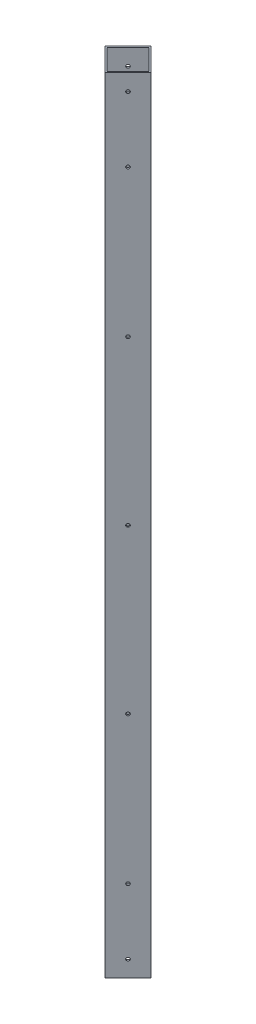
ISO-10303-21;
HEADER;
FILE_DESCRIPTION(('STEP AP214'),'2;1');
FILE_NAME('part.step','',(''),(''),'','','');
FILE_SCHEMA(('AUTOMOTIVE_DESIGN { 1 0 10303 214 1 1 1 1 }'));
ENDSEC;
DATA;
#1=APPLICATION_CONTEXT('core data for automotive mechanical design processes');
#2=APPLICATION_PROTOCOL_DEFINITION('international standard','automotive_design',2000,#1);
#3=PRODUCT_CONTEXT('',#1,'mechanical');
#4=PRODUCT('Part','Part','',(#3));
#5=PRODUCT_RELATED_PRODUCT_CATEGORY('part','',(#4));
#6=PRODUCT_DEFINITION_FORMATION('','',#4);
#7=PRODUCT_DEFINITION_CONTEXT('part definition',#1,'design');
#8=PRODUCT_DEFINITION('design','',#6,#7);
#9=PRODUCT_DEFINITION_SHAPE('','',#8);
#10=(LENGTH_UNIT() NAMED_UNIT(*) SI_UNIT(.MILLI.,.METRE.));
#11=(NAMED_UNIT(*) PLANE_ANGLE_UNIT() SI_UNIT($,.RADIAN.));
#12=(NAMED_UNIT(*) SI_UNIT($,.STERADIAN.) SOLID_ANGLE_UNIT());
#13=UNCERTAINTY_MEASURE_WITH_UNIT(LENGTH_MEASURE(1.E-05),#10,'distance_accuracy_value','');
#14=(GEOMETRIC_REPRESENTATION_CONTEXT(3) GLOBAL_UNCERTAINTY_ASSIGNED_CONTEXT((#13)) GLOBAL_UNIT_ASSIGNED_CONTEXT((#10,
#11,#12)) REPRESENTATION_CONTEXT('',''));
#15=CARTESIAN_POINT('',(0.,0.,0.));
#16=DIRECTION('',(0.,0.,1.));
#17=DIRECTION('',(1.,0.,0.));
#18=AXIS2_PLACEMENT_3D('',#15,#16,#17);
#19=CARTESIAN_POINT('',(0.,240.,0.));
#20=DIRECTION('',(0.,1.,0.));
#21=DIRECTION('',(0.,0.,1.));
#22=AXIS2_PLACEMENT_3D('',#19,#20,#21);
#23=PLANE('',#22);
#24=DIRECTION('',(0.707106781186544,0.,-0.707106781186551));
#25=VECTOR('',#24,1.);
#26=CARTESIAN_POINT('',(1.472650518087E-13,240.,14.1421356237309));
#27=LINE('',#26,#25);
#28=CARTESIAN_POINT('',(1.472650518087E-13,240.,14.1421356237309));
#29=VERTEX_POINT('',#28);
#30=CARTESIAN_POINT('',(14.1421356237309,240.,0.));
#31=VERTEX_POINT('',#30);
#32=EDGE_CURVE('E139',#29,#31,#27,.T.);
#33=ORIENTED_EDGE('',*,*,#32,.T.);
#34=DIRECTION('',(-0.707106781186549,0.,-0.707106781186546));
#35=VECTOR('',#34,1.);
#36=CARTESIAN_POINT('',(14.1421356237309,240.,0.));
#37=LINE('',#36,#35);
#38=CARTESIAN_POINT('',(0.,240.,-14.1421356237309));
#39=VERTEX_POINT('',#38);
#40=EDGE_CURVE('E142',#31,#39,#37,.T.);
#41=ORIENTED_EDGE('',*,*,#40,.T.);
#42=DIRECTION('',(-0.707106781186544,0.,0.707106781186551));
#43=VECTOR('',#42,1.);
#44=CARTESIAN_POINT('',(0.,240.,-14.1421356237309));
#45=LINE('',#44,#43);
#46=CARTESIAN_POINT('',(-14.1421356237309,240.,0.));
#47=VERTEX_POINT('',#46);
#48=EDGE_CURVE('E145',#39,#47,#45,.T.);
#49=ORIENTED_EDGE('',*,*,#48,.T.);
#50=DIRECTION('',(0.707106781186554,0.,0.707106781186541));
#51=VECTOR('',#50,1.);
#52=CARTESIAN_POINT('',(-14.1421356237309,240.,0.));
#53=LINE('',#52,#51);
#54=EDGE_CURVE('E147',#47,#29,#53,.T.);
#55=ORIENTED_EDGE('',*,*,#54,.T.);
#56=EDGE_LOOP('',(#33,#41,#49,#55));
#57=FACE_BOUND('',#56,.T.);
#58=DIRECTION('',(-0.707106781186545,0.,-0.707106781186549));
#59=VECTOR('',#58,1.);
#60=CARTESIAN_POINT('',(12.7279220613579,240.,0.));
#61=LINE('',#60,#59);
#62=CARTESIAN_POINT('',(12.7279220613579,240.,0.));
#63=VERTEX_POINT('',#62);
#64=CARTESIAN_POINT('',(0.,240.,-12.7279220613579));
#65=VERTEX_POINT('',#64);
#66=EDGE_CURVE('E109',#63,#65,#61,.T.);
#67=ORIENTED_EDGE('',*,*,#66,.F.);
#68=DIRECTION('',(0.707106781186552,0.,-0.707106781186543));
#69=VECTOR('',#68,1.);
#70=CARTESIAN_POINT('',(0.,240.,12.7279220613578));
#71=LINE('',#70,#69);
#72=CARTESIAN_POINT('',(0.,240.,12.7279220613578));
#73=VERTEX_POINT('',#72);
#74=EDGE_CURVE('E101',#73,#63,#71,.T.);
#75=ORIENTED_EDGE('',*,*,#74,.F.);
#76=DIRECTION('',(0.707106781186545,0.,0.70710678118655));
#77=VECTOR('',#76,1.);
#78=CARTESIAN_POINT('',(-12.7279220613578,240.,0.));
#79=LINE('',#78,#77);
#80=CARTESIAN_POINT('',(-12.7279220613578,240.,0.));
#81=VERTEX_POINT('',#80);
#82=EDGE_CURVE('E123',#81,#73,#79,.T.);
#83=ORIENTED_EDGE('',*,*,#82,.F.);
#84=DIRECTION('',(-0.707106781186547,0.,0.707106781186548));
#85=VECTOR('',#84,1.);
#86=CARTESIAN_POINT('',(0.,240.,-12.7279220613579));
#87=LINE('',#86,#85);
#88=EDGE_CURVE('E121',#65,#81,#87,.T.);
#89=ORIENTED_EDGE('',*,*,#88,.F.);
#90=EDGE_LOOP('',(#67,#75,#83,#89));
#91=FACE_BOUND('',#90,.T.);
#92=ADVANCED_FACE('F34',(#57,#91),#23,.T.);
#93=CARTESIAN_POINT('',(0.,-240.,0.));
#94=DIRECTION('',(0.,1.,0.));
#95=DIRECTION('',(0.,0.,1.));
#96=AXIS2_PLACEMENT_3D('',#93,#94,#95);
#97=PLANE('',#96);
#98=DIRECTION('',(0.707106781186544,0.,-0.707106781186551));
#99=VECTOR('',#98,1.);
#100=CARTESIAN_POINT('',(1.472650518087E-13,-240.,14.1421356237309));
#101=LINE('',#100,#99);
#102=CARTESIAN_POINT('',(1.472650518087E-13,-240.,14.1421356237309));
#103=VERTEX_POINT('',#102);
#104=CARTESIAN_POINT('',(14.1421356237309,-240.,0.));
#105=VERTEX_POINT('',#104);
#106=EDGE_CURVE('E117',#103,#105,#101,.T.);
#107=ORIENTED_EDGE('',*,*,#106,.F.);
#108=DIRECTION('',(0.707106781186554,0.,0.707106781186541));
#109=VECTOR('',#108,1.);
#110=CARTESIAN_POINT('',(-14.1421356237309,-240.,0.));
#111=LINE('',#110,#109);
#112=CARTESIAN_POINT('',(-14.1421356237309,-240.,0.));
#113=VERTEX_POINT('',#112);
#114=EDGE_CURVE('E143',#113,#103,#111,.T.);
#115=ORIENTED_EDGE('',*,*,#114,.F.);
#116=DIRECTION('',(-0.707106781186544,0.,0.707106781186551));
#117=VECTOR('',#116,1.);
#118=CARTESIAN_POINT('',(0.,-240.,-14.1421356237309));
#119=LINE('',#118,#117);
#120=CARTESIAN_POINT('',(0.,-240.,-14.1421356237309));
#121=VERTEX_POINT('',#120);
#122=EDGE_CURVE('E154',#121,#113,#119,.T.);
#123=ORIENTED_EDGE('',*,*,#122,.F.);
#124=DIRECTION('',(-0.707106781186549,0.,-0.707106781186546));
#125=VECTOR('',#124,1.);
#126=CARTESIAN_POINT('',(14.1421356237309,-240.,0.));
#127=LINE('',#126,#125);
#128=EDGE_CURVE('E152',#105,#121,#127,.T.);
#129=ORIENTED_EDGE('',*,*,#128,.F.);
#130=EDGE_LOOP('',(#107,#115,#123,#129));
#131=FACE_BOUND('',#130,.T.);
#132=DIRECTION('',(0.707106781186552,0.,-0.707106781186543));
#133=VECTOR('',#132,1.);
#134=CARTESIAN_POINT('',(0.,-240.,12.7279220613578));
#135=LINE('',#134,#133);
#136=CARTESIAN_POINT('',(0.,-240.,12.7279220613578));
#137=VERTEX_POINT('',#136);
#138=CARTESIAN_POINT('',(12.7279220613579,-240.,0.));
#139=VERTEX_POINT('',#138);
#140=EDGE_CURVE('E59',#137,#139,#135,.T.);
#141=ORIENTED_EDGE('',*,*,#140,.T.);
#142=DIRECTION('',(-0.707106781186545,0.,-0.707106781186549));
#143=VECTOR('',#142,1.);
#144=CARTESIAN_POINT('',(12.7279220613579,-240.,0.));
#145=LINE('',#144,#143);
#146=CARTESIAN_POINT('',(0.,-240.,-12.7279220613579));
#147=VERTEX_POINT('',#146);
#148=EDGE_CURVE('E116',#139,#147,#145,.T.);
#149=ORIENTED_EDGE('',*,*,#148,.T.);
#150=DIRECTION('',(-0.707106781186547,0.,0.707106781186548));
#151=VECTOR('',#150,1.);
#152=CARTESIAN_POINT('',(0.,-240.,-12.7279220613579));
#153=LINE('',#152,#151);
#154=CARTESIAN_POINT('',(-12.7279220613578,-240.,0.));
#155=VERTEX_POINT('',#154);
#156=EDGE_CURVE('E131',#147,#155,#153,.T.);
#157=ORIENTED_EDGE('',*,*,#156,.T.);
#158=DIRECTION('',(0.707106781186545,0.,0.70710678118655));
#159=VECTOR('',#158,1.);
#160=CARTESIAN_POINT('',(-12.7279220613578,-240.,0.));
#161=LINE('',#160,#159);
#162=EDGE_CURVE('E110',#155,#137,#161,.T.);
#163=ORIENTED_EDGE('',*,*,#162,.T.);
#164=EDGE_LOOP('',(#141,#149,#157,#163));
#165=FACE_BOUND('',#164,.T.);
#166=ADVANCED_FACE('F267',(#131,#165),#97,.F.);
#167=CARTESIAN_POINT('',(1.472650518087E-13,240.,14.1421356237309));
#168=DIRECTION('',(-0.707106781186551,0.,-0.707106781186544));
#169=DIRECTION('',(-0.707106781186544,0.,0.707106781186551));
#170=AXIS2_PLACEMENT_3D('',#167,#168,#169);
#171=PLANE('',#170);
#172=CARTESIAN_POINT('',(7.07106781186554,100.,7.07106781186546));
#173=DIRECTION('',(0.707106781186551,0.,0.707106781186544));
#174=DIRECTION('',(0.707106781186544,0.,-0.707106781186551));
#175=AXIS2_PLACEMENT_3D('',#172,#173,#174);
#176=CIRCLE('',#175,1.);
#177=CARTESIAN_POINT('',(7.77817459305208,100.,6.36396103067891));
#178=VERTEX_POINT('',#177);
#179=EDGE_CURVE('E187',#178,#178,#176,.T.);
#180=ORIENTED_EDGE('',*,*,#179,.F.);
#181=EDGE_LOOP('',(#180));
#182=FACE_BOUND('',#181,.T.);
#183=CARTESIAN_POINT('',(7.07106781186554,0.,7.07106781186546));
#184=DIRECTION('',(0.707106781186551,0.,0.707106781186544));
#185=DIRECTION('',(0.707106781186544,0.,-0.707106781186551));
#186=AXIS2_PLACEMENT_3D('',#183,#184,#185);
#187=CIRCLE('',#186,1.);
#188=CARTESIAN_POINT('',(7.77817459305208,0.,6.36396103067891));
#189=VERTEX_POINT('',#188);
#190=EDGE_CURVE('E484',#189,#189,#187,.T.);
#191=ORIENTED_EDGE('',*,*,#190,.F.);
#192=EDGE_LOOP('',(#191));
#193=FACE_BOUND('',#192,.T.);
#194=CARTESIAN_POINT('',(7.07106781186554,-100.,7.07106781186546));
#195=DIRECTION('',(0.707106781186551,0.,0.707106781186544));
#196=DIRECTION('',(0.707106781186544,0.,-0.707106781186551));
#197=AXIS2_PLACEMENT_3D('',#194,#195,#196);
#198=CIRCLE('',#197,1.);
#199=CARTESIAN_POINT('',(7.77817459305208,-100.,6.36396103067891));
#200=VERTEX_POINT('',#199);
#201=EDGE_CURVE('E487',#200,#200,#198,.T.);
#202=ORIENTED_EDGE('',*,*,#201,.F.);
#203=EDGE_LOOP('',(#202));
#204=FACE_BOUND('',#203,.T.);
#205=CARTESIAN_POINT('',(7.07106781186554,230.,7.07106781186546));
#206=DIRECTION('',(0.707106781186551,0.,0.707106781186544));
#207=DIRECTION('',(0.707106781186544,0.,-0.707106781186551));
#208=AXIS2_PLACEMENT_3D('',#205,#206,#207);
#209=CIRCLE('',#208,1.);
#210=CARTESIAN_POINT('',(7.77817459305208,230.,6.36396103067891));
#211=VERTEX_POINT('',#210);
#212=EDGE_CURVE('E168',#211,#211,#209,.T.);
#213=ORIENTED_EDGE('',*,*,#212,.F.);
#214=EDGE_LOOP('',(#213));
#215=FACE_BOUND('',#214,.T.);
#216=CARTESIAN_POINT('',(7.07106781186554,190.,7.07106781186546));
#217=DIRECTION('',(0.707106781186551,0.,0.707106781186544));
#218=DIRECTION('',(0.707106781186544,0.,-0.707106781186551));
#219=AXIS2_PLACEMENT_3D('',#216,#217,#218);
#220=CIRCLE('',#219,1.);
#221=CARTESIAN_POINT('',(7.77817459305208,190.,6.36396103067891));
#222=VERTEX_POINT('',#221);
#223=EDGE_CURVE('E216',#222,#222,#220,.T.);
#224=ORIENTED_EDGE('',*,*,#223,.F.);
#225=EDGE_LOOP('',(#224));
#226=FACE_BOUND('',#225,.T.);
#227=CARTESIAN_POINT('',(7.07106781186554,-190.,7.07106781186546));
#228=DIRECTION('',(0.707106781186551,0.,0.707106781186544));
#229=DIRECTION('',(-0.707106781186544,0.,0.707106781186551));
#230=AXIS2_PLACEMENT_3D('',#227,#228,#229);
#231=CIRCLE('',#230,1.);
#232=CARTESIAN_POINT('',(6.36396103067899,-190.,7.77817459305202));
#233=VERTEX_POINT('',#232);
#234=EDGE_CURVE('E219',#233,#233,#231,.T.);
#235=ORIENTED_EDGE('',*,*,#234,.F.);
#236=EDGE_LOOP('',(#235));
#237=FACE_BOUND('',#236,.T.);
#238=CARTESIAN_POINT('',(7.07106781186554,-230.,7.07106781186546));
#239=DIRECTION('',(0.707106781186551,0.,0.707106781186544));
#240=DIRECTION('',(-0.707106781186544,0.,0.707106781186551));
#241=AXIS2_PLACEMENT_3D('',#238,#239,#240);
#242=CIRCLE('',#241,1.);
#243=CARTESIAN_POINT('',(6.36396103067899,-230.,7.77817459305202));
#244=VERTEX_POINT('',#243);
#245=EDGE_CURVE('E213',#244,#244,#242,.T.);
#246=ORIENTED_EDGE('',*,*,#245,.F.);
#247=EDGE_LOOP('',(#246));
#248=FACE_BOUND('',#247,.T.);
#249=ORIENTED_EDGE('',*,*,#106,.T.);
#250=DIRECTION('',(0.,-1.,0.));
#251=VECTOR('',#250,1.);
#252=CARTESIAN_POINT('',(14.1421356237309,240.,0.));
#253=LINE('',#252,#251);
#254=EDGE_CURVE('E11',#31,#105,#253,.T.);
#255=ORIENTED_EDGE('',*,*,#254,.F.);
#256=ORIENTED_EDGE('',*,*,#32,.F.);
#257=DIRECTION('',(0.,-1.,0.));
#258=VECTOR('',#257,1.);
#259=CARTESIAN_POINT('',(1.472650518087E-13,240.,14.1421356237309));
#260=LINE('',#259,#258);
#261=EDGE_CURVE('E149',#29,#103,#260,.T.);
#262=ORIENTED_EDGE('',*,*,#261,.T.);
#263=EDGE_LOOP('',(#249,#255,#256,#262));
#264=FACE_BOUND('',#263,.T.);
#265=ADVANCED_FACE('F36',(#182,#193,#204,#215,#226,#237,#248,#264),#171,.F.);
#266=CARTESIAN_POINT('',(14.1421356237309,240.,0.));
#267=DIRECTION('',(-0.707106781186546,0.,0.707106781186549));
#268=DIRECTION('',(0.707106781186549,0.,0.707106781186546));
#269=AXIS2_PLACEMENT_3D('',#266,#267,#268);
#270=PLANE('',#269);
#271=ORIENTED_EDGE('',*,*,#128,.T.);
#272=DIRECTION('',(0.,-1.,0.));
#273=VECTOR('',#272,1.);
#274=CARTESIAN_POINT('',(0.,240.,-14.1421356237309));
#275=LINE('',#274,#273);
#276=EDGE_CURVE('E43',#39,#121,#275,.T.);
#277=ORIENTED_EDGE('',*,*,#276,.F.);
#278=ORIENTED_EDGE('',*,*,#40,.F.);
#279=ORIENTED_EDGE('',*,*,#254,.T.);
#280=EDGE_LOOP('',(#271,#277,#278,#279));
#281=FACE_BOUND('',#280,.T.);
#282=ADVANCED_FACE('F283',(#281),#270,.F.);
#283=CARTESIAN_POINT('',(0.,240.,-14.1421356237309));
#284=DIRECTION('',(0.707106781186551,0.,0.707106781186544));
#285=DIRECTION('',(0.707106781186544,0.,-0.707106781186551));
#286=AXIS2_PLACEMENT_3D('',#283,#284,#285);
#287=PLANE('',#286);
#288=CARTESIAN_POINT('',(-7.07106781186549,100.,-7.07106781186541));
#289=DIRECTION('',(0.707106781186551,0.,0.707106781186544));
#290=DIRECTION('',(0.707106781186544,0.,-0.707106781186551));
#291=AXIS2_PLACEMENT_3D('',#288,#289,#290);
#292=CIRCLE('',#291,1.);
#293=CARTESIAN_POINT('',(-6.36396103067895,100.,-7.77817459305196));
#294=VERTEX_POINT('',#293);
#295=EDGE_CURVE('E210',#294,#294,#292,.T.);
#296=ORIENTED_EDGE('',*,*,#295,.T.);
#297=EDGE_LOOP('',(#296));
#298=FACE_BOUND('',#297,.T.);
#299=CARTESIAN_POINT('',(-7.07106781186549,0.,-7.07106781186541));
#300=DIRECTION('',(0.707106781186551,0.,0.707106781186544));
#301=DIRECTION('',(0.707106781186544,0.,-0.707106781186551));
#302=AXIS2_PLACEMENT_3D('',#299,#300,#301);
#303=CIRCLE('',#302,1.);
#304=CARTESIAN_POINT('',(-6.36396103067895,0.,-7.77817459305196));
#305=VERTEX_POINT('',#304);
#306=EDGE_CURVE('E195',#305,#305,#303,.T.);
#307=ORIENTED_EDGE('',*,*,#306,.T.);
#308=EDGE_LOOP('',(#307));
#309=FACE_BOUND('',#308,.T.);
#310=CARTESIAN_POINT('',(-7.07106781186549,-100.,-7.07106781186541));
#311=DIRECTION('',(0.707106781186551,0.,0.707106781186544));
#312=DIRECTION('',(0.707106781186544,0.,-0.707106781186551));
#313=AXIS2_PLACEMENT_3D('',#310,#311,#312);
#314=CIRCLE('',#313,1.);
#315=CARTESIAN_POINT('',(-6.36396103067895,-100.,-7.77817459305196));
#316=VERTEX_POINT('',#315);
#317=EDGE_CURVE('E191',#316,#316,#314,.T.);
#318=ORIENTED_EDGE('',*,*,#317,.T.);
#319=EDGE_LOOP('',(#318));
#320=FACE_BOUND('',#319,.T.);
#321=CARTESIAN_POINT('',(-7.07106781186549,230.,-7.07106781186541));
#322=DIRECTION('',(0.707106781186551,0.,0.707106781186544));
#323=DIRECTION('',(0.707106781186544,0.,-0.707106781186551));
#324=AXIS2_PLACEMENT_3D('',#321,#322,#323);
#325=CIRCLE('',#324,1.);
#326=CARTESIAN_POINT('',(-6.36396103067895,230.,-7.77817459305197));
#327=VERTEX_POINT('',#326);
#328=EDGE_CURVE('E129',#327,#327,#325,.T.);
#329=ORIENTED_EDGE('',*,*,#328,.T.);
#330=EDGE_LOOP('',(#329));
#331=FACE_BOUND('',#330,.T.);
#332=CARTESIAN_POINT('',(-7.07106781186549,190.,-7.07106781186541));
#333=DIRECTION('',(0.707106781186551,0.,0.707106781186544));
#334=DIRECTION('',(0.707106781186544,0.,-0.707106781186551));
#335=AXIS2_PLACEMENT_3D('',#332,#333,#334);
#336=CIRCLE('',#335,1.);
#337=CARTESIAN_POINT('',(-6.36396103067895,190.,-7.77817459305197));
#338=VERTEX_POINT('',#337);
#339=EDGE_CURVE('E183',#338,#338,#336,.T.);
#340=ORIENTED_EDGE('',*,*,#339,.T.);
#341=EDGE_LOOP('',(#340));
#342=FACE_BOUND('',#341,.T.);
#343=CARTESIAN_POINT('',(-7.07106781186549,-190.,-7.07106781186541));
#344=DIRECTION('',(0.707106781186551,0.,0.707106781186544));
#345=DIRECTION('',(0.707106781186544,0.,-0.707106781186551));
#346=AXIS2_PLACEMENT_3D('',#343,#344,#345);
#347=CIRCLE('',#346,1.);
#348=CARTESIAN_POINT('',(-6.36396103067895,-190.,-7.77817459305197));
#349=VERTEX_POINT('',#348);
#350=EDGE_CURVE('E178',#349,#349,#347,.T.);
#351=ORIENTED_EDGE('',*,*,#350,.T.);
#352=EDGE_LOOP('',(#351));
#353=FACE_BOUND('',#352,.T.);
#354=CARTESIAN_POINT('',(-7.07106781186549,-230.,-7.07106781186541));
#355=DIRECTION('',(0.707106781186551,0.,0.707106781186544));
#356=DIRECTION('',(0.707106781186544,0.,-0.707106781186551));
#357=AXIS2_PLACEMENT_3D('',#354,#355,#356);
#358=CIRCLE('',#357,1.);
#359=CARTESIAN_POINT('',(-6.36396103067895,-230.,-7.77817459305197));
#360=VERTEX_POINT('',#359);
#361=EDGE_CURVE('E173',#360,#360,#358,.T.);
#362=ORIENTED_EDGE('',*,*,#361,.T.);
#363=EDGE_LOOP('',(#362));
#364=FACE_BOUND('',#363,.T.);
#365=ORIENTED_EDGE('',*,*,#122,.T.);
#366=DIRECTION('',(0.,-1.,0.));
#367=VECTOR('',#366,1.);
#368=CARTESIAN_POINT('',(-14.1421356237309,240.,0.));
#369=LINE('',#368,#367);
#370=EDGE_CURVE('E159',#47,#113,#369,.T.);
#371=ORIENTED_EDGE('',*,*,#370,.F.);
#372=ORIENTED_EDGE('',*,*,#48,.F.);
#373=ORIENTED_EDGE('',*,*,#276,.T.);
#374=EDGE_LOOP('',(#365,#371,#372,#373));
#375=FACE_BOUND('',#374,.T.);
#376=ADVANCED_FACE('F240',(#298,#309,#320,#331,#342,#353,#364,#375),#287,.F.);
#377=CARTESIAN_POINT('',(-14.1421356237309,240.,0.));
#378=DIRECTION('',(0.707106781186541,0.,-0.707106781186554));
#379=DIRECTION('',(-0.707106781186554,0.,-0.707106781186541));
#380=AXIS2_PLACEMENT_3D('',#377,#378,#379);
#381=PLANE('',#380);
#382=ORIENTED_EDGE('',*,*,#114,.T.);
#383=ORIENTED_EDGE('',*,*,#261,.F.);
#384=ORIENTED_EDGE('',*,*,#54,.F.);
#385=ORIENTED_EDGE('',*,*,#370,.T.);
#386=EDGE_LOOP('',(#382,#383,#384,#385));
#387=FACE_BOUND('',#386,.T.);
#388=ADVANCED_FACE('F278',(#387),#381,.F.);
#389=CARTESIAN_POINT('',(0.,240.,12.7279220613578));
#390=DIRECTION('',(-0.707106781186543,0.,-0.707106781186552));
#391=DIRECTION('',(-0.707106781186552,0.,0.707106781186543));
#392=AXIS2_PLACEMENT_3D('',#389,#390,#391);
#393=PLANE('',#392);
#394=CARTESIAN_POINT('',(6.36396103067896,100.,6.36396103067889));
#395=DIRECTION('',(-0.707106781186543,0.,-0.707106781186552));
#396=DIRECTION('',(-0.707106781186552,0.,0.707106781186543));
#397=AXIS2_PLACEMENT_3D('',#394,#395,#396);
#398=CIRCLE('',#397,1.);
#399=CARTESIAN_POINT('',(5.65685424949241,100.,7.07106781186544));
#400=VERTEX_POINT('',#399);
#401=EDGE_CURVE('E207',#400,#400,#398,.T.);
#402=ORIENTED_EDGE('',*,*,#401,.F.);
#403=EDGE_LOOP('',(#402));
#404=FACE_BOUND('',#403,.T.);
#405=CARTESIAN_POINT('',(6.36396103067896,0.,6.36396103067889));
#406=DIRECTION('',(-0.707106781186543,0.,-0.707106781186552));
#407=DIRECTION('',(-0.707106781186552,0.,0.707106781186543));
#408=AXIS2_PLACEMENT_3D('',#405,#406,#407);
#409=CIRCLE('',#408,1.);
#410=CARTESIAN_POINT('',(5.65685424949241,0.,7.07106781186544));
#411=VERTEX_POINT('',#410);
#412=EDGE_CURVE('E190',#411,#411,#409,.T.);
#413=ORIENTED_EDGE('',*,*,#412,.F.);
#414=EDGE_LOOP('',(#413));
#415=FACE_BOUND('',#414,.T.);
#416=CARTESIAN_POINT('',(6.36396103067896,-100.,6.36396103067889));
#417=DIRECTION('',(-0.707106781186543,0.,-0.707106781186552));
#418=DIRECTION('',(-0.707106781186552,0.,0.707106781186543));
#419=AXIS2_PLACEMENT_3D('',#416,#417,#418);
#420=CIRCLE('',#419,1.);
#421=CARTESIAN_POINT('',(5.65685424949241,-100.,7.07106781186544));
#422=VERTEX_POINT('',#421);
#423=EDGE_CURVE('E186',#422,#422,#420,.T.);
#424=ORIENTED_EDGE('',*,*,#423,.F.);
#425=EDGE_LOOP('',(#424));
#426=FACE_BOUND('',#425,.T.);
#427=CARTESIAN_POINT('',(6.36396103067896,230.,6.36396103067889));
#428=DIRECTION('',(-0.707106781186543,0.,-0.707106781186552));
#429=DIRECTION('',(-0.707106781186552,0.,0.707106781186543));
#430=AXIS2_PLACEMENT_3D('',#427,#428,#429);
#431=CIRCLE('',#430,1.);
#432=CARTESIAN_POINT('',(5.65685424949241,230.,7.07106781186543));
#433=VERTEX_POINT('',#432);
#434=EDGE_CURVE('E182',#433,#433,#431,.T.);
#435=ORIENTED_EDGE('',*,*,#434,.F.);
#436=EDGE_LOOP('',(#435));
#437=FACE_BOUND('',#436,.T.);
#438=CARTESIAN_POINT('',(6.36396103067896,190.,6.36396103067889));
#439=DIRECTION('',(-0.707106781186543,0.,-0.707106781186552));
#440=DIRECTION('',(-0.707106781186552,0.,0.707106781186543));
#441=AXIS2_PLACEMENT_3D('',#438,#439,#440);
#442=CIRCLE('',#441,1.);
#443=CARTESIAN_POINT('',(5.65685424949241,190.,7.07106781186543));
#444=VERTEX_POINT('',#443);
#445=EDGE_CURVE('E177',#444,#444,#442,.T.);
#446=ORIENTED_EDGE('',*,*,#445,.F.);
#447=EDGE_LOOP('',(#446));
#448=FACE_BOUND('',#447,.T.);
#449=CARTESIAN_POINT('',(6.36396103067896,-190.,6.36396103067889));
#450=DIRECTION('',(-0.707106781186543,0.,-0.707106781186552));
#451=DIRECTION('',(-0.707106781186552,0.,0.707106781186543));
#452=AXIS2_PLACEMENT_3D('',#449,#450,#451);
#453=CIRCLE('',#452,1.);
#454=CARTESIAN_POINT('',(5.65685424949241,-190.,7.07106781186543));
#455=VERTEX_POINT('',#454);
#456=EDGE_CURVE('E172',#455,#455,#453,.T.);
#457=ORIENTED_EDGE('',*,*,#456,.F.);
#458=EDGE_LOOP('',(#457));
#459=FACE_BOUND('',#458,.T.);
#460=CARTESIAN_POINT('',(6.36396103067896,-230.,6.36396103067889));
#461=DIRECTION('',(-0.707106781186543,0.,-0.707106781186552));
#462=DIRECTION('',(-0.707106781186552,0.,0.707106781186543));
#463=AXIS2_PLACEMENT_3D('',#460,#461,#462);
#464=CIRCLE('',#463,1.);
#465=CARTESIAN_POINT('',(5.65685424949241,-230.,7.07106781186543));
#466=VERTEX_POINT('',#465);
#467=EDGE_CURVE('E167',#466,#466,#464,.T.);
#468=ORIENTED_EDGE('',*,*,#467,.F.);
#469=EDGE_LOOP('',(#468));
#470=FACE_BOUND('',#469,.T.);
#471=ORIENTED_EDGE('',*,*,#140,.F.);
#472=DIRECTION('',(0.,-1.,0.));
#473=VECTOR('',#472,1.);
#474=CARTESIAN_POINT('',(0.,240.,12.7279220613578));
#475=LINE('',#474,#473);
#476=EDGE_CURVE('E105',#73,#137,#475,.T.);
#477=ORIENTED_EDGE('',*,*,#476,.F.);
#478=ORIENTED_EDGE('',*,*,#74,.T.);
#479=DIRECTION('',(0.,-1.,0.));
#480=VECTOR('',#479,1.);
#481=CARTESIAN_POINT('',(12.7279220613579,240.,0.));
#482=LINE('',#481,#480);
#483=EDGE_CURVE('E104',#63,#139,#482,.T.);
#484=ORIENTED_EDGE('',*,*,#483,.T.);
#485=EDGE_LOOP('',(#471,#477,#478,#484));
#486=FACE_BOUND('',#485,.T.);
#487=ADVANCED_FACE('F103',(#404,#415,#426,#437,#448,#459,#470,#486),#393,.T.);
#488=CARTESIAN_POINT('',(12.7279220613579,240.,0.));
#489=DIRECTION('',(-0.707106781186549,0.,0.707106781186546));
#490=DIRECTION('',(0.707106781186546,0.,0.707106781186549));
#491=AXIS2_PLACEMENT_3D('',#488,#489,#490);
#492=PLANE('',#491);
#493=ORIENTED_EDGE('',*,*,#148,.F.);
#494=ORIENTED_EDGE('',*,*,#483,.F.);
#495=ORIENTED_EDGE('',*,*,#66,.T.);
#496=DIRECTION('',(0.,-1.,0.));
#497=VECTOR('',#496,1.);
#498=CARTESIAN_POINT('',(0.,240.,-12.7279220613579));
#499=LINE('',#498,#497);
#500=EDGE_CURVE('E118',#65,#147,#499,.T.);
#501=ORIENTED_EDGE('',*,*,#500,.T.);
#502=EDGE_LOOP('',(#493,#494,#495,#501));
#503=FACE_BOUND('',#502,.T.);
#504=ADVANCED_FACE('F113',(#503),#492,.T.);
#505=CARTESIAN_POINT('',(0.,240.,-12.7279220613579));
#506=DIRECTION('',(0.707106781186548,0.,0.707106781186547));
#507=DIRECTION('',(0.707106781186547,0.,-0.707106781186548));
#508=AXIS2_PLACEMENT_3D('',#505,#506,#507);
#509=PLANE('',#508);
#510=CARTESIAN_POINT('',(-6.36396103067896,100.,-6.36396103067889));
#511=DIRECTION('',(0.707106781186548,0.,0.707106781186547));
#512=DIRECTION('',(0.707106781186547,0.,-0.707106781186548));
#513=AXIS2_PLACEMENT_3D('',#510,#511,#512);
#514=CIRCLE('',#513,1.);
#515=CARTESIAN_POINT('',(-5.65685424949241,100.,-7.07106781186544));
#516=VERTEX_POINT('',#515);
#517=EDGE_CURVE('E38',#516,#516,#514,.T.);
#518=ORIENTED_EDGE('',*,*,#517,.F.);
#519=EDGE_LOOP('',(#518));
#520=FACE_BOUND('',#519,.T.);
#521=CARTESIAN_POINT('',(-6.36396103067896,0.,-6.36396103067889));
#522=DIRECTION('',(0.707106781186548,0.,0.707106781186547));
#523=DIRECTION('',(0.707106781186547,0.,-0.707106781186548));
#524=AXIS2_PLACEMENT_3D('',#521,#522,#523);
#525=CIRCLE('',#524,1.);
#526=CARTESIAN_POINT('',(-5.65685424949241,0.,-7.07106781186544));
#527=VERTEX_POINT('',#526);
#528=EDGE_CURVE('E188',#527,#527,#525,.T.);
#529=ORIENTED_EDGE('',*,*,#528,.F.);
#530=EDGE_LOOP('',(#529));
#531=FACE_BOUND('',#530,.T.);
#532=CARTESIAN_POINT('',(-6.36396103067896,-100.,-6.36396103067889));
#533=DIRECTION('',(0.707106781186548,0.,0.707106781186547));
#534=DIRECTION('',(0.707106781186547,0.,-0.707106781186548));
#535=AXIS2_PLACEMENT_3D('',#532,#533,#534);
#536=CIRCLE('',#535,1.);
#537=CARTESIAN_POINT('',(-5.65685424949241,-100.,-7.07106781186544));
#538=VERTEX_POINT('',#537);
#539=EDGE_CURVE('E184',#538,#538,#536,.T.);
#540=ORIENTED_EDGE('',*,*,#539,.F.);
#541=EDGE_LOOP('',(#540));
#542=FACE_BOUND('',#541,.T.);
#543=CARTESIAN_POINT('',(-6.36396103067896,230.,-6.36396103067889));
#544=DIRECTION('',(0.707106781186548,0.,0.707106781186547));
#545=DIRECTION('',(0.707106781186547,0.,-0.707106781186548));
#546=AXIS2_PLACEMENT_3D('',#543,#544,#545);
#547=CIRCLE('',#546,1.);
#548=CARTESIAN_POINT('',(-5.65685424949241,230.,-7.07106781186544));
#549=VERTEX_POINT('',#548);
#550=EDGE_CURVE('E179',#549,#549,#547,.T.);
#551=ORIENTED_EDGE('',*,*,#550,.F.);
#552=EDGE_LOOP('',(#551));
#553=FACE_BOUND('',#552,.T.);
#554=CARTESIAN_POINT('',(-6.36396103067896,190.,-6.36396103067889));
#555=DIRECTION('',(0.707106781186548,0.,0.707106781186547));
#556=DIRECTION('',(0.707106781186547,0.,-0.707106781186548));
#557=AXIS2_PLACEMENT_3D('',#554,#555,#556);
#558=CIRCLE('',#557,1.);
#559=CARTESIAN_POINT('',(-5.65685424949241,190.,-7.07106781186544));
#560=VERTEX_POINT('',#559);
#561=EDGE_CURVE('E174',#560,#560,#558,.T.);
#562=ORIENTED_EDGE('',*,*,#561,.F.);
#563=EDGE_LOOP('',(#562));
#564=FACE_BOUND('',#563,.T.);
#565=CARTESIAN_POINT('',(-6.36396103067896,-190.,-6.36396103067889));
#566=DIRECTION('',(0.707106781186548,0.,0.707106781186547));
#567=DIRECTION('',(0.707106781186547,0.,-0.707106781186548));
#568=AXIS2_PLACEMENT_3D('',#565,#566,#567);
#569=CIRCLE('',#568,1.);
#570=CARTESIAN_POINT('',(-5.65685424949241,-190.,-7.07106781186544));
#571=VERTEX_POINT('',#570);
#572=EDGE_CURVE('E169',#571,#571,#569,.T.);
#573=ORIENTED_EDGE('',*,*,#572,.F.);
#574=EDGE_LOOP('',(#573));
#575=FACE_BOUND('',#574,.T.);
#576=CARTESIAN_POINT('',(-6.36396103067896,-230.,-6.36396103067889));
#577=DIRECTION('',(0.707106781186548,0.,0.707106781186547));
#578=DIRECTION('',(0.707106781186547,0.,-0.707106781186548));
#579=AXIS2_PLACEMENT_3D('',#576,#577,#578);
#580=CIRCLE('',#579,1.);
#581=CARTESIAN_POINT('',(-5.65685424949241,-230.,-7.07106781186544));
#582=VERTEX_POINT('',#581);
#583=EDGE_CURVE('E164',#582,#582,#580,.T.);
#584=ORIENTED_EDGE('',*,*,#583,.F.);
#585=EDGE_LOOP('',(#584));
#586=FACE_BOUND('',#585,.T.);
#587=ORIENTED_EDGE('',*,*,#156,.F.);
#588=ORIENTED_EDGE('',*,*,#500,.F.);
#589=ORIENTED_EDGE('',*,*,#88,.T.);
#590=DIRECTION('',(0.,-1.,0.));
#591=VECTOR('',#590,1.);
#592=CARTESIAN_POINT('',(-12.7279220613578,240.,0.));
#593=LINE('',#592,#591);
#594=EDGE_CURVE('E51',#81,#155,#593,.T.);
#595=ORIENTED_EDGE('',*,*,#594,.T.);
#596=EDGE_LOOP('',(#587,#588,#589,#595));
#597=FACE_BOUND('',#596,.T.);
#598=ADVANCED_FACE('F307',(#520,#531,#542,#553,#564,#575,#586,#597),#509,.T.);
#599=CARTESIAN_POINT('',(-12.7279220613578,240.,0.));
#600=DIRECTION('',(0.70710678118655,0.,-0.707106781186545));
#601=DIRECTION('',(-0.707106781186545,0.,-0.70710678118655));
#602=AXIS2_PLACEMENT_3D('',#599,#600,#601);
#603=PLANE('',#602);
#604=ORIENTED_EDGE('',*,*,#162,.F.);
#605=ORIENTED_EDGE('',*,*,#594,.F.);
#606=ORIENTED_EDGE('',*,*,#82,.T.);
#607=ORIENTED_EDGE('',*,*,#476,.T.);
#608=EDGE_LOOP('',(#604,#605,#606,#607));
#609=FACE_BOUND('',#608,.T.);
#610=ADVANCED_FACE('F305',(#609),#603,.T.);
#611=CARTESIAN_POINT('',(-14.142135623731,-230.,-14.1421356237309));
#612=DIRECTION('',(0.707106781186551,0.,0.707106781186544));
#613=DIRECTION('',(0.707106781186544,0.,-0.707106781186551));
#614=AXIS2_PLACEMENT_3D('',#611,#612,#613);
#615=CYLINDRICAL_SURFACE('',#614,1.);
#616=ORIENTED_EDGE('',*,*,#583,.T.);
#617=EDGE_LOOP('',(#616));
#618=FACE_BOUND('',#617,.T.);
#619=ORIENTED_EDGE('',*,*,#361,.F.);
#620=EDGE_LOOP('',(#619));
#621=FACE_BOUND('',#620,.T.);
#622=ADVANCED_FACE('F257',(#618,#621),#615,.F.);
#623=CARTESIAN_POINT('',(-14.142135623731,-190.,-14.1421356237309));
#624=DIRECTION('',(0.707106781186551,0.,0.707106781186544));
#625=DIRECTION('',(0.707106781186544,0.,-0.707106781186551));
#626=AXIS2_PLACEMENT_3D('',#623,#624,#625);
#627=CYLINDRICAL_SURFACE('',#626,1.);
#628=ORIENTED_EDGE('',*,*,#572,.T.);
#629=EDGE_LOOP('',(#628));
#630=FACE_BOUND('',#629,.T.);
#631=ORIENTED_EDGE('',*,*,#350,.F.);
#632=EDGE_LOOP('',(#631));
#633=FACE_BOUND('',#632,.T.);
#634=ADVANCED_FACE('F258',(#630,#633),#627,.F.);
#635=CARTESIAN_POINT('',(-14.142135623731,190.,-14.1421356237309));
#636=DIRECTION('',(0.707106781186551,0.,0.707106781186544));
#637=DIRECTION('',(0.707106781186544,0.,-0.707106781186551));
#638=AXIS2_PLACEMENT_3D('',#635,#636,#637);
#639=CYLINDRICAL_SURFACE('',#638,1.);
#640=ORIENTED_EDGE('',*,*,#561,.T.);
#641=EDGE_LOOP('',(#640));
#642=FACE_BOUND('',#641,.T.);
#643=ORIENTED_EDGE('',*,*,#339,.F.);
#644=EDGE_LOOP('',(#643));
#645=FACE_BOUND('',#644,.T.);
#646=ADVANCED_FACE('F246',(#642,#645),#639,.F.);
#647=CARTESIAN_POINT('',(-14.142135623731,230.,-14.1421356237309));
#648=DIRECTION('',(0.707106781186551,0.,0.707106781186544));
#649=DIRECTION('',(0.707106781186544,0.,-0.707106781186551));
#650=AXIS2_PLACEMENT_3D('',#647,#648,#649);
#651=CYLINDRICAL_SURFACE('',#650,1.);
#652=ORIENTED_EDGE('',*,*,#550,.T.);
#653=EDGE_LOOP('',(#652));
#654=FACE_BOUND('',#653,.T.);
#655=ORIENTED_EDGE('',*,*,#328,.F.);
#656=EDGE_LOOP('',(#655));
#657=FACE_BOUND('',#656,.T.);
#658=ADVANCED_FACE('F243',(#654,#657),#651,.F.);
#659=ORIENTED_EDGE('',*,*,#467,.T.);
#660=EDGE_LOOP('',(#659));
#661=FACE_BOUND('',#660,.T.);
#662=ORIENTED_EDGE('',*,*,#245,.T.);
#663=EDGE_LOOP('',(#662));
#664=FACE_BOUND('',#663,.T.);
#665=ADVANCED_FACE('F245',(#661,#664),#615,.F.);
#666=ORIENTED_EDGE('',*,*,#456,.T.);
#667=EDGE_LOOP('',(#666));
#668=FACE_BOUND('',#667,.T.);
#669=ORIENTED_EDGE('',*,*,#234,.T.);
#670=EDGE_LOOP('',(#669));
#671=FACE_BOUND('',#670,.T.);
#672=ADVANCED_FACE('F254',(#668,#671),#627,.F.);
#673=ORIENTED_EDGE('',*,*,#445,.T.);
#674=EDGE_LOOP('',(#673));
#675=FACE_BOUND('',#674,.T.);
#676=ORIENTED_EDGE('',*,*,#223,.T.);
#677=EDGE_LOOP('',(#676));
#678=FACE_BOUND('',#677,.T.);
#679=ADVANCED_FACE('F261',(#675,#678),#639,.F.);
#680=ORIENTED_EDGE('',*,*,#434,.T.);
#681=EDGE_LOOP('',(#680));
#682=FACE_BOUND('',#681,.T.);
#683=ORIENTED_EDGE('',*,*,#212,.T.);
#684=EDGE_LOOP('',(#683));
#685=FACE_BOUND('',#684,.T.);
#686=ADVANCED_FACE('F249',(#682,#685),#651,.F.);
#687=CARTESIAN_POINT('',(-14.142135623731,-100.,-14.1421356237309));
#688=DIRECTION('',(0.707106781186551,0.,0.707106781186544));
#689=DIRECTION('',(0.707106781186544,0.,-0.707106781186551));
#690=AXIS2_PLACEMENT_3D('',#687,#688,#689);
#691=CYLINDRICAL_SURFACE('',#690,1.);
#692=ORIENTED_EDGE('',*,*,#539,.T.);
#693=EDGE_LOOP('',(#692));
#694=FACE_BOUND('',#693,.T.);
#695=ORIENTED_EDGE('',*,*,#317,.F.);
#696=EDGE_LOOP('',(#695));
#697=FACE_BOUND('',#696,.T.);
#698=ADVANCED_FACE('F264',(#694,#697),#691,.F.);
#699=CARTESIAN_POINT('',(-14.142135623731,0.,-14.1421356237309));
#700=DIRECTION('',(0.707106781186551,0.,0.707106781186544));
#701=DIRECTION('',(0.707106781186544,0.,-0.707106781186551));
#702=AXIS2_PLACEMENT_3D('',#699,#700,#701);
#703=CYLINDRICAL_SURFACE('',#702,1.);
#704=ORIENTED_EDGE('',*,*,#528,.T.);
#705=EDGE_LOOP('',(#704));
#706=FACE_BOUND('',#705,.T.);
#707=ORIENTED_EDGE('',*,*,#306,.F.);
#708=EDGE_LOOP('',(#707));
#709=FACE_BOUND('',#708,.T.);
#710=ADVANCED_FACE('F432',(#706,#709),#703,.F.);
#711=CARTESIAN_POINT('',(-14.142135623731,100.,-14.1421356237309));
#712=DIRECTION('',(0.707106781186551,0.,0.707106781186544));
#713=DIRECTION('',(0.707106781186544,0.,-0.707106781186551));
#714=AXIS2_PLACEMENT_3D('',#711,#712,#713);
#715=CYLINDRICAL_SURFACE('',#714,1.);
#716=ORIENTED_EDGE('',*,*,#517,.T.);
#717=EDGE_LOOP('',(#716));
#718=FACE_BOUND('',#717,.T.);
#719=ORIENTED_EDGE('',*,*,#295,.F.);
#720=EDGE_LOOP('',(#719));
#721=FACE_BOUND('',#720,.T.);
#722=ADVANCED_FACE('F442',(#718,#721),#715,.F.);
#723=ORIENTED_EDGE('',*,*,#423,.T.);
#724=EDGE_LOOP('',(#723));
#725=FACE_BOUND('',#724,.T.);
#726=ORIENTED_EDGE('',*,*,#201,.T.);
#727=EDGE_LOOP('',(#726));
#728=FACE_BOUND('',#727,.T.);
#729=ADVANCED_FACE('F434',(#725,#728),#691,.F.);
#730=ORIENTED_EDGE('',*,*,#412,.T.);
#731=EDGE_LOOP('',(#730));
#732=FACE_BOUND('',#731,.T.);
#733=ORIENTED_EDGE('',*,*,#190,.T.);
#734=EDGE_LOOP('',(#733));
#735=FACE_BOUND('',#734,.T.);
#736=ADVANCED_FACE('F444',(#732,#735),#703,.F.);
#737=ORIENTED_EDGE('',*,*,#401,.T.);
#738=EDGE_LOOP('',(#737));
#739=FACE_BOUND('',#738,.T.);
#740=ORIENTED_EDGE('',*,*,#179,.T.);
#741=EDGE_LOOP('',(#740));
#742=FACE_BOUND('',#741,.T.);
#743=ADVANCED_FACE('F454',(#739,#742),#715,.F.);
#744=CLOSED_SHELL('',(#92,#166,#265,#282,#376,#388,#487,#504,#598,#610,#622,#634,#646,#658,#665,
#672,#679,#686,#698,#710,#722,#729,#736,#743));
#745=MANIFOLD_SOLID_BREP('B2',#744);
#746=ADVANCED_BREP_SHAPE_REPRESENTATION('',(#18,#745),#14);
#747=SHAPE_DEFINITION_REPRESENTATION(#9,#746);
ENDSEC;
END-ISO-10303-21;
